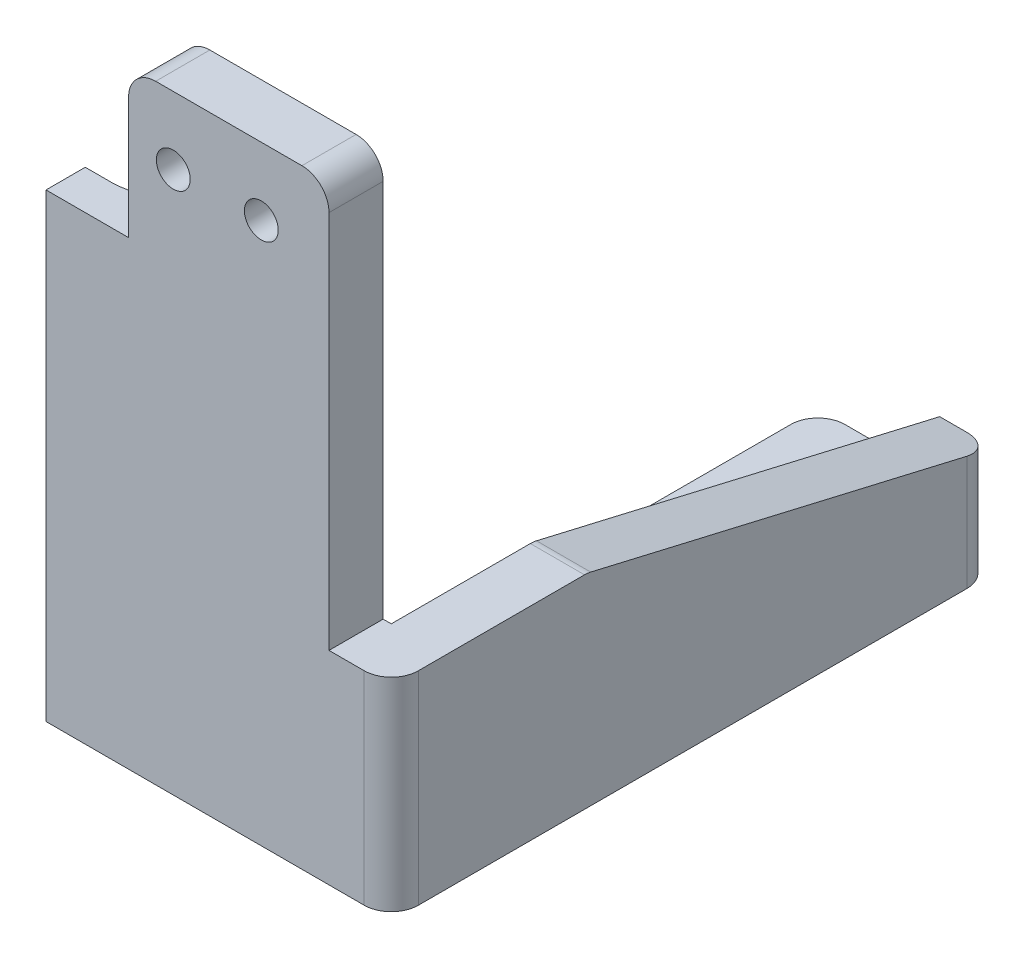
ISO-10303-21;
HEADER;
FILE_DESCRIPTION(('STEP AP214'),'2;1');
FILE_NAME('part.step','',(''),(''),'','','');
FILE_SCHEMA(('AUTOMOTIVE_DESIGN { 1 0 10303 214 1 1 1 1 }'));
ENDSEC;
DATA;
#1=APPLICATION_CONTEXT('core data for automotive mechanical design processes');
#2=APPLICATION_PROTOCOL_DEFINITION('international standard','automotive_design',2000,#1);
#3=PRODUCT_CONTEXT('',#1,'mechanical');
#4=PRODUCT('Part','Part','',(#3));
#5=PRODUCT_RELATED_PRODUCT_CATEGORY('part','',(#4));
#6=PRODUCT_DEFINITION_FORMATION('','',#4);
#7=PRODUCT_DEFINITION_CONTEXT('part definition',#1,'design');
#8=PRODUCT_DEFINITION('design','',#6,#7);
#9=PRODUCT_DEFINITION_SHAPE('','',#8);
#10=(LENGTH_UNIT() NAMED_UNIT(*) SI_UNIT(.MILLI.,.METRE.));
#11=(NAMED_UNIT(*) PLANE_ANGLE_UNIT() SI_UNIT($,.RADIAN.));
#12=(NAMED_UNIT(*) SI_UNIT($,.STERADIAN.) SOLID_ANGLE_UNIT());
#13=UNCERTAINTY_MEASURE_WITH_UNIT(LENGTH_MEASURE(1.E-05),#10,'distance_accuracy_value','');
#14=(GEOMETRIC_REPRESENTATION_CONTEXT(3) GLOBAL_UNCERTAINTY_ASSIGNED_CONTEXT((#13)) GLOBAL_UNIT_ASSIGNED_CONTEXT((#10,
#11,#12)) REPRESENTATION_CONTEXT('',''));
#15=CARTESIAN_POINT('',(0.,0.,0.));
#16=DIRECTION('',(0.,0.,1.));
#17=DIRECTION('',(1.,0.,0.));
#18=AXIS2_PLACEMENT_3D('',#15,#16,#17);
#19=CARTESIAN_POINT('',(0.,-36.,0.));
#20=DIRECTION('',(0.,1.,0.));
#21=DIRECTION('',(0.,0.,1.));
#22=AXIS2_PLACEMENT_3D('',#19,#20,#21);
#23=PLANE('',#22);
#24=CARTESIAN_POINT('',(4.35000000000001,-36.,-37.5));
#25=DIRECTION('',(0.,-1.,0.));
#26=DIRECTION('',(0.,0.,-1.));
#27=AXIS2_PLACEMENT_3D('',#24,#25,#26);
#28=CIRCLE('',#27,1.75);
#29=CARTESIAN_POINT('',(4.35000000000001,-36.,-39.25));
#30=VERTEX_POINT('',#29);
#31=EDGE_CURVE('E250',#30,#30,#28,.T.);
#32=ORIENTED_EDGE('',*,*,#31,.T.);
#33=EDGE_LOOP('',(#32));
#34=FACE_BOUND('',#33,.T.);
#35=CARTESIAN_POINT('',(4.35000000000001,-36.,-6.5));
#36=DIRECTION('',(0.,-1.,0.));
#37=DIRECTION('',(0.,0.,-1.));
#38=AXIS2_PLACEMENT_3D('',#35,#36,#37);
#39=CIRCLE('',#38,1.75);
#40=CARTESIAN_POINT('',(4.35000000000001,-36.,-8.25));
#41=VERTEX_POINT('',#40);
#42=EDGE_CURVE('E241',#41,#41,#39,.T.);
#43=ORIENTED_EDGE('',*,*,#42,.T.);
#44=EDGE_LOOP('',(#43));
#45=FACE_BOUND('',#44,.T.);
#46=DIRECTION('',(1.,0.,0.));
#47=VECTOR('',#46,1.);
#48=CARTESIAN_POINT('',(-0.149999999999992,-36.,-42.5));
#49=LINE('',#48,#47);
#50=CARTESIAN_POINT('',(1.85000000000001,-36.,-42.5));
#51=VERTEX_POINT('',#50);
#52=CARTESIAN_POINT('',(8.85000000000001,-36.,-42.5));
#53=VERTEX_POINT('',#52);
#54=EDGE_CURVE('E261',#51,#53,#49,.T.);
#55=ORIENTED_EDGE('',*,*,#54,.F.);
#56=CARTESIAN_POINT('',(1.85000000000001,-36.,-40.5));
#57=DIRECTION('',(0.,1.,0.));
#58=DIRECTION('',(0.,0.,1.));
#59=AXIS2_PLACEMENT_3D('',#56,#57,#58);
#60=CIRCLE('',#59,2.);
#61=CARTESIAN_POINT('',(-0.149999999999992,-36.,-40.5));
#62=VERTEX_POINT('',#61);
#63=EDGE_CURVE('E415',#51,#62,#60,.T.);
#64=ORIENTED_EDGE('',*,*,#63,.T.);
#65=DIRECTION('',(0.,0.,-1.));
#66=VECTOR('',#65,1.);
#67=CARTESIAN_POINT('',(-0.149999999999992,-36.,-42.5));
#68=LINE('',#67,#66);
#69=CARTESIAN_POINT('',(-0.149999999999992,-36.,-6.49999999999998));
#70=VERTEX_POINT('',#69);
#71=EDGE_CURVE('E257',#70,#62,#68,.T.);
#72=ORIENTED_EDGE('',*,*,#71,.F.);
#73=DIRECTION('',(-0.707106781186546,0.,-0.707106781186549));
#74=VECTOR('',#73,1.);
#75=CARTESIAN_POINT('',(-4.55,-36.,-10.9));
#76=LINE('',#75,#74);
#77=CARTESIAN_POINT('',(0.450000000000003,-36.,-5.89999999999998));
#78=VERTEX_POINT('',#77);
#79=EDGE_CURVE('E371',#70,#78,#76,.F.);
#80=ORIENTED_EDGE('',*,*,#79,.T.);
#81=DIRECTION('',(0.,0.,1.));
#82=VECTOR('',#81,1.);
#83=CARTESIAN_POINT('',(0.450000000000003,-36.,-2.));
#84=LINE('',#83,#82);
#85=CARTESIAN_POINT('',(0.450000000000003,-36.,-2.));
#86=VERTEX_POINT('',#85);
#87=EDGE_CURVE('E263',#78,#86,#84,.T.);
#88=ORIENTED_EDGE('',*,*,#87,.T.);
#89=DIRECTION('',(-1.,0.,0.));
#90=VECTOR('',#89,1.);
#91=CARTESIAN_POINT('',(0.,-36.,-2.));
#92=LINE('',#91,#90);
#93=CARTESIAN_POINT('',(8.85000000000001,-36.,-2.));
#94=VERTEX_POINT('',#93);
#95=EDGE_CURVE('E269',#94,#86,#92,.T.);
#96=ORIENTED_EDGE('',*,*,#95,.F.);
#97=DIRECTION('',(0.,0.,1.));
#98=VECTOR('',#97,1.);
#99=CARTESIAN_POINT('',(8.85000000000001,-36.,-42.5));
#100=LINE('',#99,#98);
#101=EDGE_CURVE('E236',#53,#94,#100,.T.);
#102=ORIENTED_EDGE('',*,*,#101,.F.);
#103=EDGE_LOOP('',(#55,#64,#72,#80,#88,#96,#102));
#104=FACE_BOUND('',#103,.T.);
#105=ADVANCED_FACE('F33',(#34,#45,#104),#23,.T.);
#106=CARTESIAN_POINT('',(0.,0.,2.));
#107=DIRECTION('',(0.,0.,1.));
#108=DIRECTION('',(1.,0.,0.));
#109=AXIS2_PLACEMENT_3D('',#106,#107,#108);
#110=PLANE('',#109);
#111=DIRECTION('',(0.,1.,0.));
#112=VECTOR('',#111,1.);
#113=CARTESIAN_POINT('',(8.25,5.,2.));
#114=LINE('',#113,#112);
#115=CARTESIAN_POINT('',(8.25000000000001,-25.,2.));
#116=VERTEX_POINT('',#115);
#117=CARTESIAN_POINT('',(8.25,3.,2.));
#118=VERTEX_POINT('',#117);
#119=EDGE_CURVE('E353',#116,#118,#114,.T.);
#120=ORIENTED_EDGE('',*,*,#119,.T.);
#121=CARTESIAN_POINT('',(6.25,3.,2.));
#122=DIRECTION('',(0.,0.,1.));
#123=DIRECTION('',(1.,0.,0.));
#124=AXIS2_PLACEMENT_3D('',#121,#122,#123);
#125=CIRCLE('',#124,2.);
#126=CARTESIAN_POINT('',(6.25,5.,2.));
#127=VERTEX_POINT('',#126);
#128=EDGE_CURVE('E41',#118,#127,#125,.T.);
#129=ORIENTED_EDGE('',*,*,#128,.T.);
#130=DIRECTION('',(-1.,0.,0.));
#131=VECTOR('',#130,1.);
#132=CARTESIAN_POINT('',(-6.55,5.,2.));
#133=LINE('',#132,#131);
#134=CARTESIAN_POINT('',(-4.55,5.,2.));
#135=VERTEX_POINT('',#134);
#136=EDGE_CURVE('E355',#127,#135,#133,.T.);
#137=ORIENTED_EDGE('',*,*,#136,.T.);
#138=CARTESIAN_POINT('',(-4.55,3.,2.));
#139=DIRECTION('',(0.,0.,1.));
#140=DIRECTION('',(1.,0.,0.));
#141=AXIS2_PLACEMENT_3D('',#138,#139,#140);
#142=CIRCLE('',#141,2.);
#143=CARTESIAN_POINT('',(-6.55,3.,2.));
#144=VERTEX_POINT('',#143);
#145=EDGE_CURVE('E48',#135,#144,#142,.T.);
#146=ORIENTED_EDGE('',*,*,#145,.T.);
#147=DIRECTION('',(0.,-1.,0.));
#148=VECTOR('',#147,1.);
#149=CARTESIAN_POINT('',(-6.55,5.,2.));
#150=LINE('',#149,#148);
#151=CARTESIAN_POINT('',(-6.55,-6.,2.));
#152=VERTEX_POINT('',#151);
#153=EDGE_CURVE('E347',#144,#152,#150,.T.);
#154=ORIENTED_EDGE('',*,*,#153,.T.);
#155=DIRECTION('',(-1.,0.,0.));
#156=VECTOR('',#155,1.);
#157=CARTESIAN_POINT('',(-12.65,-6.,2.));
#158=LINE('',#157,#156);
#159=CARTESIAN_POINT('',(-12.65,-6.,2.));
#160=VERTEX_POINT('',#159);
#161=EDGE_CURVE('E279',#152,#160,#158,.T.);
#162=ORIENTED_EDGE('',*,*,#161,.T.);
#163=DIRECTION('',(0.,-1.,0.));
#164=VECTOR('',#163,1.);
#165=CARTESIAN_POINT('',(-12.65,-6.,2.));
#166=LINE('',#165,#164);
#167=CARTESIAN_POINT('',(-12.65,-40.,2.));
#168=VERTEX_POINT('',#167);
#169=EDGE_CURVE('E302',#160,#168,#166,.T.);
#170=ORIENTED_EDGE('',*,*,#169,.T.);
#171=DIRECTION('',(1.,0.,0.));
#172=VECTOR('',#171,1.);
#173=CARTESIAN_POINT('',(-6.55,-40.,2.));
#174=LINE('',#173,#172);
#175=CARTESIAN_POINT('',(10.85,-40.,2.));
#176=VERTEX_POINT('',#175);
#177=EDGE_CURVE('E349',#168,#176,#174,.T.);
#178=ORIENTED_EDGE('',*,*,#177,.T.);
#179=DIRECTION('',(0.,-1.,0.));
#180=VECTOR('',#179,1.);
#181=CARTESIAN_POINT('',(10.85,-25.,2.));
#182=LINE('',#181,#180);
#183=CARTESIAN_POINT('',(10.85,-25.,2.));
#184=VERTEX_POINT('',#183);
#185=EDGE_CURVE('E405',#176,#184,#182,.F.);
#186=ORIENTED_EDGE('',*,*,#185,.T.);
#187=DIRECTION('',(1.,0.,0.));
#188=VECTOR('',#187,1.);
#189=CARTESIAN_POINT('',(8.25000000000001,-25.,2.));
#190=LINE('',#189,#188);
#191=EDGE_CURVE('E440',#116,#184,#190,.T.);
#192=ORIENTED_EDGE('',*,*,#191,.F.);
#193=EDGE_LOOP('',(#120,#129,#137,#146,#154,#162,#170,#178,#186,#192));
#194=FACE_BOUND('',#193,.T.);
#195=CARTESIAN_POINT('',(-3.25,0.,2.));
#196=DIRECTION('',(0.,0.,1.));
#197=DIRECTION('',(1.,0.,0.));
#198=AXIS2_PLACEMENT_3D('',#195,#196,#197);
#199=CIRCLE('',#198,1.25);
#200=CARTESIAN_POINT('',(-2.,0.,2.));
#201=VERTEX_POINT('',#200);
#202=EDGE_CURVE('E341',#201,#201,#199,.T.);
#203=ORIENTED_EDGE('',*,*,#202,.F.);
#204=EDGE_LOOP('',(#203));
#205=FACE_BOUND('',#204,.T.);
#206=CARTESIAN_POINT('',(3.25,0.,2.));
#207=DIRECTION('',(0.,0.,1.));
#208=DIRECTION('',(-1.,0.,0.));
#209=AXIS2_PLACEMENT_3D('',#206,#207,#208);
#210=CIRCLE('',#209,1.25);
#211=CARTESIAN_POINT('',(2.,0.,2.));
#212=VERTEX_POINT('',#211);
#213=EDGE_CURVE('E335',#212,#212,#210,.T.);
#214=ORIENTED_EDGE('',*,*,#213,.F.);
#215=EDGE_LOOP('',(#214));
#216=FACE_BOUND('',#215,.T.);
#217=ADVANCED_FACE('F429',(#194,#205,#216),#110,.T.);
#218=CARTESIAN_POINT('',(0.,0.,-2.));
#219=DIRECTION('',(0.,0.,1.));
#220=DIRECTION('',(1.,0.,0.));
#221=AXIS2_PLACEMENT_3D('',#218,#219,#220);
#222=PLANE('',#221);
#223=DIRECTION('',(-1.,0.,0.));
#224=VECTOR('',#223,1.);
#225=CARTESIAN_POINT('',(-6.55,5.,-2.));
#226=LINE('',#225,#224);
#227=CARTESIAN_POINT('',(6.25,5.,-2.));
#228=VERTEX_POINT('',#227);
#229=CARTESIAN_POINT('',(-4.55,5.,-2.));
#230=VERTEX_POINT('',#229);
#231=EDGE_CURVE('E350',#228,#230,#226,.T.);
#232=ORIENTED_EDGE('',*,*,#231,.F.);
#233=CARTESIAN_POINT('',(6.25,3.,-2.));
#234=DIRECTION('',(0.,0.,1.));
#235=DIRECTION('',(1.,0.,0.));
#236=AXIS2_PLACEMENT_3D('',#233,#234,#235);
#237=CIRCLE('',#236,2.);
#238=CARTESIAN_POINT('',(8.25,3.,-2.));
#239=VERTEX_POINT('',#238);
#240=EDGE_CURVE('E424',#228,#239,#237,.F.);
#241=ORIENTED_EDGE('',*,*,#240,.T.);
#242=DIRECTION('',(0.,1.,0.));
#243=VECTOR('',#242,1.);
#244=CARTESIAN_POINT('',(8.25,5.,-2.));
#245=LINE('',#244,#243);
#246=CARTESIAN_POINT('',(8.25000000000001,-25.,-2.));
#247=VERTEX_POINT('',#246);
#248=EDGE_CURVE('E229',#247,#239,#245,.T.);
#249=ORIENTED_EDGE('',*,*,#248,.F.);
#250=DIRECTION('',(-1.,0.,0.));
#251=VECTOR('',#250,1.);
#252=CARTESIAN_POINT('',(8.25000000000001,-25.,-2.));
#253=LINE('',#252,#251);
#254=CARTESIAN_POINT('',(8.85000000000001,-25.,-2.));
#255=VERTEX_POINT('',#254);
#256=EDGE_CURVE('E213',#255,#247,#253,.T.);
#257=ORIENTED_EDGE('',*,*,#256,.F.);
#258=DIRECTION('',(0.,-1.,0.));
#259=VECTOR('',#258,1.);
#260=CARTESIAN_POINT('',(8.85000000000001,-25.,-2.));
#261=LINE('',#260,#259);
#262=EDGE_CURVE('E228',#255,#94,#261,.T.);
#263=ORIENTED_EDGE('',*,*,#262,.T.);
#264=ORIENTED_EDGE('',*,*,#95,.T.);
#265=DIRECTION('',(0.,-1.,0.));
#266=VECTOR('',#265,1.);
#267=CARTESIAN_POINT('',(0.450000000000003,-6.,-2.));
#268=LINE('',#267,#266);
#269=CARTESIAN_POINT('',(0.450000000000003,-6.,-2.));
#270=VERTEX_POINT('',#269);
#271=EDGE_CURVE('E319',#270,#86,#268,.T.);
#272=ORIENTED_EDGE('',*,*,#271,.F.);
#273=DIRECTION('',(-1.,0.,0.));
#274=VECTOR('',#273,1.);
#275=CARTESIAN_POINT('',(-6.55,-6.,-2.));
#276=LINE('',#275,#274);
#277=CARTESIAN_POINT('',(-6.55,-6.,-2.));
#278=VERTEX_POINT('',#277);
#279=EDGE_CURVE('E272',#270,#278,#276,.T.);
#280=ORIENTED_EDGE('',*,*,#279,.T.);
#281=DIRECTION('',(0.,-1.,0.));
#282=VECTOR('',#281,1.);
#283=CARTESIAN_POINT('',(-6.55,5.,-2.));
#284=LINE('',#283,#282);
#285=CARTESIAN_POINT('',(-6.55,3.,-2.));
#286=VERTEX_POINT('',#285);
#287=EDGE_CURVE('E344',#286,#278,#284,.T.);
#288=ORIENTED_EDGE('',*,*,#287,.F.);
#289=CARTESIAN_POINT('',(-4.55,3.,-2.));
#290=DIRECTION('',(0.,0.,1.));
#291=DIRECTION('',(1.,0.,0.));
#292=AXIS2_PLACEMENT_3D('',#289,#290,#291);
#293=CIRCLE('',#292,2.);
#294=EDGE_CURVE('E422',#286,#230,#293,.F.);
#295=ORIENTED_EDGE('',*,*,#294,.T.);
#296=EDGE_LOOP('',(#232,#241,#249,#257,#263,#264,#272,#280,#288,#295));
#297=FACE_BOUND('',#296,.T.);
#298=CARTESIAN_POINT('',(-3.25,0.,-2.));
#299=DIRECTION('',(0.,0.,1.));
#300=DIRECTION('',(1.,0.,0.));
#301=AXIS2_PLACEMENT_3D('',#298,#299,#300);
#302=CIRCLE('',#301,1.25);
#303=CARTESIAN_POINT('',(-2.,0.,-2.));
#304=VERTEX_POINT('',#303);
#305=EDGE_CURVE('E338',#304,#304,#302,.T.);
#306=ORIENTED_EDGE('',*,*,#305,.T.);
#307=EDGE_LOOP('',(#306));
#308=FACE_BOUND('',#307,.T.);
#309=CARTESIAN_POINT('',(3.25,0.,-2.));
#310=DIRECTION('',(0.,0.,1.));
#311=DIRECTION('',(-1.,0.,0.));
#312=AXIS2_PLACEMENT_3D('',#309,#310,#311);
#313=CIRCLE('',#312,1.25);
#314=CARTESIAN_POINT('',(2.,0.,-2.));
#315=VERTEX_POINT('',#314);
#316=EDGE_CURVE('E322',#315,#315,#313,.T.);
#317=ORIENTED_EDGE('',*,*,#316,.T.);
#318=EDGE_LOOP('',(#317));
#319=FACE_BOUND('',#318,.T.);
#320=ADVANCED_FACE('F225',(#297,#308,#319),#222,.F.);
#321=CARTESIAN_POINT('',(-6.55,5.,2.));
#322=DIRECTION('',(1.,0.,0.));
#323=DIRECTION('',(0.,1.,0.));
#324=AXIS2_PLACEMENT_3D('',#321,#322,#323);
#325=PLANE('',#324);
#326=ORIENTED_EDGE('',*,*,#153,.F.);
#327=DIRECTION('',(0.,0.,-1.));
#328=VECTOR('',#327,1.);
#329=CARTESIAN_POINT('',(-6.55,3.,2.));
#330=LINE('',#329,#328);
#331=EDGE_CURVE('E11',#144,#286,#330,.T.);
#332=ORIENTED_EDGE('',*,*,#331,.T.);
#333=ORIENTED_EDGE('',*,*,#287,.T.);
#334=DIRECTION('',(0.,0.,1.));
#335=VECTOR('',#334,1.);
#336=CARTESIAN_POINT('',(-6.55,-6.,-2.));
#337=LINE('',#336,#335);
#338=EDGE_CURVE('E275',#278,#152,#337,.T.);
#339=ORIENTED_EDGE('',*,*,#338,.T.);
#340=EDGE_LOOP('',(#326,#332,#333,#339));
#341=FACE_BOUND('',#340,.T.);
#342=ADVANCED_FACE('F482',(#341),#325,.F.);
#343=CARTESIAN_POINT('',(-6.55,-40.,2.));
#344=DIRECTION('',(0.,1.,0.));
#345=DIRECTION('',(0.,0.,1.));
#346=AXIS2_PLACEMENT_3D('',#343,#344,#345);
#347=PLANE('',#346);
#348=DIRECTION('',(0.,0.,-1.));
#349=VECTOR('',#348,1.);
#350=CARTESIAN_POINT('',(12.85,-40.,-42.5));
#351=LINE('',#350,#349);
#352=CARTESIAN_POINT('',(12.85,-40.,0.));
#353=VERTEX_POINT('',#352);
#354=CARTESIAN_POINT('',(12.85,-40.,-40.5));
#355=VERTEX_POINT('',#354);
#356=EDGE_CURVE('E219',#353,#355,#351,.T.);
#357=ORIENTED_EDGE('',*,*,#356,.F.);
#358=CARTESIAN_POINT('',(10.85,-40.,0.));
#359=DIRECTION('',(0.,1.,0.));
#360=DIRECTION('',(0.,0.,1.));
#361=AXIS2_PLACEMENT_3D('',#358,#359,#360);
#362=CIRCLE('',#361,2.);
#363=EDGE_CURVE('E403',#353,#176,#362,.F.);
#364=ORIENTED_EDGE('',*,*,#363,.T.);
#365=ORIENTED_EDGE('',*,*,#177,.F.);
#366=DIRECTION('',(0.,0.,-1.));
#367=VECTOR('',#366,1.);
#368=CARTESIAN_POINT('',(-12.65,-40.,-0.9));
#369=LINE('',#368,#367);
#370=CARTESIAN_POINT('',(-12.65,-40.,-0.9));
#371=VERTEX_POINT('',#370);
#372=EDGE_CURVE('E271',#168,#371,#369,.T.);
#373=ORIENTED_EDGE('',*,*,#372,.T.);
#374=DIRECTION('',(1.,0.,0.));
#375=VECTOR('',#374,1.);
#376=CARTESIAN_POINT('',(-10.65,-40.,-0.900000000000001));
#377=LINE('',#376,#375);
#378=CARTESIAN_POINT('',(-10.65,-40.,-0.900000000000001));
#379=VERTEX_POINT('',#378);
#380=EDGE_CURVE('E305',#371,#379,#377,.T.);
#381=ORIENTED_EDGE('',*,*,#380,.T.);
#382=CARTESIAN_POINT('',(-10.65,-40.,-5.));
#383=DIRECTION('',(0.,1.,0.));
#384=DIRECTION('',(0.,0.,1.));
#385=AXIS2_PLACEMENT_3D('',#382,#383,#384);
#386=CIRCLE('',#385,4.1);
#387=CARTESIAN_POINT('',(-10.65,-40.,-9.1));
#388=VERTEX_POINT('',#387);
#389=EDGE_CURVE('E308',#379,#388,#386,.T.);
#390=ORIENTED_EDGE('',*,*,#389,.T.);
#391=DIRECTION('',(-1.,0.,0.));
#392=VECTOR('',#391,1.);
#393=CARTESIAN_POINT('',(-12.65,-40.,-9.1));
#394=LINE('',#393,#392);
#395=CARTESIAN_POINT('',(-12.65,-40.,-9.1));
#396=VERTEX_POINT('',#395);
#397=EDGE_CURVE('E311',#388,#396,#394,.T.);
#398=ORIENTED_EDGE('',*,*,#397,.T.);
#399=DIRECTION('',(0.,0.,-1.));
#400=VECTOR('',#399,1.);
#401=CARTESIAN_POINT('',(-12.65,-40.,-10.9));
#402=LINE('',#401,#400);
#403=CARTESIAN_POINT('',(-12.65,-40.,-10.9));
#404=VERTEX_POINT('',#403);
#405=EDGE_CURVE('E314',#396,#404,#402,.T.);
#406=ORIENTED_EDGE('',*,*,#405,.T.);
#407=DIRECTION('',(1.,0.,0.));
#408=VECTOR('',#407,1.);
#409=CARTESIAN_POINT('',(0.450000000000003,-40.,-10.9));
#410=LINE('',#409,#408);
#411=CARTESIAN_POINT('',(-4.55,-40.,-10.9));
#412=VERTEX_POINT('',#411);
#413=EDGE_CURVE('E276',#404,#412,#410,.T.);
#414=ORIENTED_EDGE('',*,*,#413,.T.);
#415=DIRECTION('',(-0.707106781186546,0.,-0.707106781186549));
#416=VECTOR('',#415,1.);
#417=CARTESIAN_POINT('',(-4.55,-40.,-10.9));
#418=LINE('',#417,#416);
#419=CARTESIAN_POINT('',(-0.149999999999992,-40.,-6.49999999999998));
#420=VERTEX_POINT('',#419);
#421=EDGE_CURVE('E364',#412,#420,#418,.F.);
#422=ORIENTED_EDGE('',*,*,#421,.T.);
#423=DIRECTION('',(0.,0.,-1.));
#424=VECTOR('',#423,1.);
#425=CARTESIAN_POINT('',(-0.149999999999992,-40.,-42.5));
#426=LINE('',#425,#424);
#427=CARTESIAN_POINT('',(-0.149999999999992,-40.,-40.5));
#428=VERTEX_POINT('',#427);
#429=EDGE_CURVE('E253',#420,#428,#426,.T.);
#430=ORIENTED_EDGE('',*,*,#429,.T.);
#431=CARTESIAN_POINT('',(1.85000000000001,-40.,-40.5));
#432=DIRECTION('',(0.,1.,0.));
#433=DIRECTION('',(0.,0.,1.));
#434=AXIS2_PLACEMENT_3D('',#431,#432,#433);
#435=CIRCLE('',#434,2.);
#436=CARTESIAN_POINT('',(1.85000000000001,-40.,-42.5));
#437=VERTEX_POINT('',#436);
#438=EDGE_CURVE('E399',#428,#437,#435,.F.);
#439=ORIENTED_EDGE('',*,*,#438,.T.);
#440=DIRECTION('',(1.,0.,0.));
#441=VECTOR('',#440,1.);
#442=CARTESIAN_POINT('',(-0.149999999999992,-40.,-42.5));
#443=LINE('',#442,#441);
#444=CARTESIAN_POINT('',(10.85,-40.,-42.5));
#445=VERTEX_POINT('',#444);
#446=EDGE_CURVE('E258',#437,#445,#443,.T.);
#447=ORIENTED_EDGE('',*,*,#446,.T.);
#448=CARTESIAN_POINT('',(10.85,-40.,-40.5));
#449=DIRECTION('',(0.,1.,0.));
#450=DIRECTION('',(0.,0.,1.));
#451=AXIS2_PLACEMENT_3D('',#448,#449,#450);
#452=CIRCLE('',#451,2.);
#453=EDGE_CURVE('E401',#445,#355,#452,.F.);
#454=ORIENTED_EDGE('',*,*,#453,.T.);
#455=EDGE_LOOP('',(#357,#364,#365,#373,#381,#390,#398,#406,#414,#422,#430,#439,#447,#454));
#456=FACE_BOUND('',#455,.T.);
#457=CARTESIAN_POINT('',(4.35000000000001,-40.,-37.5));
#458=DIRECTION('',(0.,-1.,0.));
#459=DIRECTION('',(0.,0.,-1.));
#460=AXIS2_PLACEMENT_3D('',#457,#458,#459);
#461=CIRCLE('',#460,1.75);
#462=CARTESIAN_POINT('',(4.35000000000001,-40.,-39.25));
#463=VERTEX_POINT('',#462);
#464=EDGE_CURVE('E248',#463,#463,#461,.T.);
#465=ORIENTED_EDGE('',*,*,#464,.F.);
#466=EDGE_LOOP('',(#465));
#467=FACE_BOUND('',#466,.T.);
#468=CARTESIAN_POINT('',(4.35000000000001,-40.,-6.5));
#469=DIRECTION('',(0.,-1.,0.));
#470=DIRECTION('',(0.,0.,-1.));
#471=AXIS2_PLACEMENT_3D('',#468,#469,#470);
#472=CIRCLE('',#471,1.75);
#473=CARTESIAN_POINT('',(4.35000000000001,-40.,-8.25));
#474=VERTEX_POINT('',#473);
#475=EDGE_CURVE('E237',#474,#474,#472,.T.);
#476=ORIENTED_EDGE('',*,*,#475,.F.);
#477=EDGE_LOOP('',(#476));
#478=FACE_BOUND('',#477,.T.);
#479=ADVANCED_FACE('F551',(#456,#467,#478),#347,.F.);
#480=CARTESIAN_POINT('',(8.25,5.,2.));
#481=DIRECTION('',(-1.,0.,0.));
#482=DIRECTION('',(0.,-1.,0.));
#483=AXIS2_PLACEMENT_3D('',#480,#481,#482);
#484=PLANE('',#483);
#485=ORIENTED_EDGE('',*,*,#248,.T.);
#486=DIRECTION('',(0.,0.,-1.));
#487=VECTOR('',#486,1.);
#488=CARTESIAN_POINT('',(8.25,3.,2.));
#489=LINE('',#488,#487);
#490=EDGE_CURVE('E56',#239,#118,#489,.F.);
#491=ORIENTED_EDGE('',*,*,#490,.T.);
#492=ORIENTED_EDGE('',*,*,#119,.F.);
#493=DIRECTION('',(0.,0.,1.));
#494=VECTOR('',#493,1.);
#495=CARTESIAN_POINT('',(8.25000000000001,-25.,-2.));
#496=LINE('',#495,#494);
#497=EDGE_CURVE('E230',#247,#116,#496,.T.);
#498=ORIENTED_EDGE('',*,*,#497,.F.);
#499=EDGE_LOOP('',(#485,#491,#492,#498));
#500=FACE_BOUND('',#499,.T.);
#501=ADVANCED_FACE('F438',(#500),#484,.F.);
#502=CARTESIAN_POINT('',(-6.55,5.,2.));
#503=DIRECTION('',(0.,-1.,0.));
#504=DIRECTION('',(0.,0.,-1.));
#505=AXIS2_PLACEMENT_3D('',#502,#503,#504);
#506=PLANE('',#505);
#507=ORIENTED_EDGE('',*,*,#136,.F.);
#508=DIRECTION('',(0.,0.,-1.));
#509=VECTOR('',#508,1.);
#510=CARTESIAN_POINT('',(6.25,5.,2.));
#511=LINE('',#510,#509);
#512=EDGE_CURVE('E419',#127,#228,#511,.T.);
#513=ORIENTED_EDGE('',*,*,#512,.T.);
#514=ORIENTED_EDGE('',*,*,#231,.T.);
#515=DIRECTION('',(0.,0.,-1.));
#516=VECTOR('',#515,1.);
#517=CARTESIAN_POINT('',(-4.55,5.,2.));
#518=LINE('',#517,#516);
#519=EDGE_CURVE('E417',#230,#135,#518,.F.);
#520=ORIENTED_EDGE('',*,*,#519,.T.);
#521=EDGE_LOOP('',(#507,#513,#514,#520));
#522=FACE_BOUND('',#521,.T.);
#523=ADVANCED_FACE('F435',(#522),#506,.F.);
#524=CARTESIAN_POINT('',(-3.25,0.,2.));
#525=DIRECTION('',(0.,0.,-1.));
#526=DIRECTION('',(-1.,0.,0.));
#527=AXIS2_PLACEMENT_3D('',#524,#525,#526);
#528=CYLINDRICAL_SURFACE('',#527,1.25);
#529=ORIENTED_EDGE('',*,*,#202,.T.);
#530=EDGE_LOOP('',(#529));
#531=FACE_BOUND('',#530,.T.);
#532=ORIENTED_EDGE('',*,*,#305,.F.);
#533=EDGE_LOOP('',(#532));
#534=FACE_BOUND('',#533,.T.);
#535=ADVANCED_FACE('F540',(#531,#534),#528,.F.);
#536=CARTESIAN_POINT('',(3.25,0.,2.));
#537=DIRECTION('',(0.,0.,-1.));
#538=DIRECTION('',(-1.,0.,0.));
#539=AXIS2_PLACEMENT_3D('',#536,#537,#538);
#540=CYLINDRICAL_SURFACE('',#539,1.25);
#541=ORIENTED_EDGE('',*,*,#213,.T.);
#542=EDGE_LOOP('',(#541));
#543=FACE_BOUND('',#542,.T.);
#544=ORIENTED_EDGE('',*,*,#316,.F.);
#545=EDGE_LOOP('',(#544));
#546=FACE_BOUND('',#545,.T.);
#547=ADVANCED_FACE('F515',(#543,#546),#540,.F.);
#548=CARTESIAN_POINT('',(0.450000000000003,-6.,-2.));
#549=DIRECTION('',(1.,0.,0.));
#550=DIRECTION('',(0.,0.,-1.));
#551=AXIS2_PLACEMENT_3D('',#548,#549,#550);
#552=PLANE('',#551);
#553=ORIENTED_EDGE('',*,*,#87,.F.);
#554=DIRECTION('',(0.,1.,0.));
#555=VECTOR('',#554,1.);
#556=CARTESIAN_POINT('',(0.450000000000003,-6.,-5.89999999999998));
#557=LINE('',#556,#555);
#558=CARTESIAN_POINT('',(0.450000000000003,-6.,-5.89999999999998));
#559=VERTEX_POINT('',#558);
#560=EDGE_CURVE('E367',#78,#559,#557,.T.);
#561=ORIENTED_EDGE('',*,*,#560,.T.);
#562=DIRECTION('',(0.,0.,1.));
#563=VECTOR('',#562,1.);
#564=CARTESIAN_POINT('',(0.450000000000003,-6.,-2.));
#565=LINE('',#564,#563);
#566=EDGE_CURVE('E300',#559,#270,#565,.T.);
#567=ORIENTED_EDGE('',*,*,#566,.T.);
#568=ORIENTED_EDGE('',*,*,#271,.T.);
#569=EDGE_LOOP('',(#553,#561,#567,#568));
#570=FACE_BOUND('',#569,.T.);
#571=ADVANCED_FACE('F471',(#570),#552,.T.);
#572=CARTESIAN_POINT('',(0.450000000000003,-6.,-10.9));
#573=DIRECTION('',(0.,0.,-1.));
#574=DIRECTION('',(-1.,0.,0.));
#575=AXIS2_PLACEMENT_3D('',#572,#573,#574);
#576=PLANE('',#575);
#577=DIRECTION('',(1.,0.,0.));
#578=VECTOR('',#577,1.);
#579=CARTESIAN_POINT('',(0.450000000000003,-6.,-10.9));
#580=LINE('',#579,#578);
#581=CARTESIAN_POINT('',(-12.65,-6.,-10.9));
#582=VERTEX_POINT('',#581);
#583=CARTESIAN_POINT('',(-4.55,-6.,-10.9));
#584=VERTEX_POINT('',#583);
#585=EDGE_CURVE('E297',#582,#584,#580,.T.);
#586=ORIENTED_EDGE('',*,*,#585,.T.);
#587=DIRECTION('',(0.,-1.,0.));
#588=VECTOR('',#587,1.);
#589=CARTESIAN_POINT('',(-4.55,-6.,-10.9));
#590=LINE('',#589,#588);
#591=EDGE_CURVE('E357',#584,#412,#590,.T.);
#592=ORIENTED_EDGE('',*,*,#591,.T.);
#593=ORIENTED_EDGE('',*,*,#413,.F.);
#594=DIRECTION('',(0.,-1.,0.));
#595=VECTOR('',#594,1.);
#596=CARTESIAN_POINT('',(-12.65,-6.,-10.9));
#597=LINE('',#596,#595);
#598=EDGE_CURVE('E323',#582,#404,#597,.T.);
#599=ORIENTED_EDGE('',*,*,#598,.F.);
#600=EDGE_LOOP('',(#586,#592,#593,#599));
#601=FACE_BOUND('',#600,.T.);
#602=ADVANCED_FACE('F514',(#601),#576,.T.);
#603=CARTESIAN_POINT('',(-12.65,-6.,-10.9));
#604=DIRECTION('',(-1.,0.,0.));
#605=DIRECTION('',(0.,0.,1.));
#606=AXIS2_PLACEMENT_3D('',#603,#604,#605);
#607=PLANE('',#606);
#608=ORIENTED_EDGE('',*,*,#405,.F.);
#609=DIRECTION('',(0.,-1.,0.));
#610=VECTOR('',#609,1.);
#611=CARTESIAN_POINT('',(-12.65,-6.,-9.1));
#612=LINE('',#611,#610);
#613=CARTESIAN_POINT('',(-12.65,-6.,-9.1));
#614=VERTEX_POINT('',#613);
#615=EDGE_CURVE('E325',#614,#396,#612,.T.);
#616=ORIENTED_EDGE('',*,*,#615,.F.);
#617=DIRECTION('',(0.,0.,-1.));
#618=VECTOR('',#617,1.);
#619=CARTESIAN_POINT('',(-12.65,-6.,-10.9));
#620=LINE('',#619,#618);
#621=EDGE_CURVE('E294',#614,#582,#620,.T.);
#622=ORIENTED_EDGE('',*,*,#621,.T.);
#623=ORIENTED_EDGE('',*,*,#598,.T.);
#624=EDGE_LOOP('',(#608,#616,#622,#623));
#625=FACE_BOUND('',#624,.T.);
#626=ADVANCED_FACE('F518',(#625),#607,.T.);
#627=CARTESIAN_POINT('',(-12.65,-6.,-9.1));
#628=DIRECTION('',(0.,0.,1.));
#629=DIRECTION('',(1.,0.,0.));
#630=AXIS2_PLACEMENT_3D('',#627,#628,#629);
#631=PLANE('',#630);
#632=ORIENTED_EDGE('',*,*,#397,.F.);
#633=DIRECTION('',(0.,-1.,0.));
#634=VECTOR('',#633,1.);
#635=CARTESIAN_POINT('',(-10.65,-6.,-9.1));
#636=LINE('',#635,#634);
#637=CARTESIAN_POINT('',(-10.65,-6.,-9.1));
#638=VERTEX_POINT('',#637);
#639=EDGE_CURVE('E327',#638,#388,#636,.T.);
#640=ORIENTED_EDGE('',*,*,#639,.F.);
#641=DIRECTION('',(-1.,0.,0.));
#642=VECTOR('',#641,1.);
#643=CARTESIAN_POINT('',(-12.65,-6.,-9.1));
#644=LINE('',#643,#642);
#645=EDGE_CURVE('E291',#638,#614,#644,.T.);
#646=ORIENTED_EDGE('',*,*,#645,.T.);
#647=ORIENTED_EDGE('',*,*,#615,.T.);
#648=EDGE_LOOP('',(#632,#640,#646,#647));
#649=FACE_BOUND('',#648,.T.);
#650=ADVANCED_FACE('F522',(#649),#631,.T.);
#651=CARTESIAN_POINT('',(-10.65,-6.,-5.));
#652=DIRECTION('',(0.,-1.,0.));
#653=DIRECTION('',(0.,0.,-1.));
#654=AXIS2_PLACEMENT_3D('',#651,#652,#653);
#655=CYLINDRICAL_SURFACE('',#654,4.1);
#656=ORIENTED_EDGE('',*,*,#389,.F.);
#657=DIRECTION('',(0.,-1.,0.));
#658=VECTOR('',#657,1.);
#659=CARTESIAN_POINT('',(-10.65,-6.,-0.900000000000001));
#660=LINE('',#659,#658);
#661=CARTESIAN_POINT('',(-10.65,-6.,-0.900000000000001));
#662=VERTEX_POINT('',#661);
#663=EDGE_CURVE('E329',#662,#379,#660,.T.);
#664=ORIENTED_EDGE('',*,*,#663,.F.);
#665=CARTESIAN_POINT('',(-10.65,-6.,-5.));
#666=DIRECTION('',(0.,1.,0.));
#667=DIRECTION('',(0.,0.,1.));
#668=AXIS2_PLACEMENT_3D('',#665,#666,#667);
#669=CIRCLE('',#668,4.1);
#670=EDGE_CURVE('E288',#662,#638,#669,.T.);
#671=ORIENTED_EDGE('',*,*,#670,.T.);
#672=ORIENTED_EDGE('',*,*,#639,.T.);
#673=EDGE_LOOP('',(#656,#664,#671,#672));
#674=FACE_BOUND('',#673,.T.);
#675=ADVANCED_FACE('F526',(#674),#655,.F.);
#676=CARTESIAN_POINT('',(-10.65,-6.,-0.900000000000001));
#677=DIRECTION('',(0.,0.,-1.));
#678=DIRECTION('',(-1.,0.,0.));
#679=AXIS2_PLACEMENT_3D('',#676,#677,#678);
#680=PLANE('',#679);
#681=ORIENTED_EDGE('',*,*,#380,.F.);
#682=DIRECTION('',(0.,-1.,0.));
#683=VECTOR('',#682,1.);
#684=CARTESIAN_POINT('',(-12.65,-6.,-0.9));
#685=LINE('',#684,#683);
#686=CARTESIAN_POINT('',(-12.65,-6.,-0.9));
#687=VERTEX_POINT('',#686);
#688=EDGE_CURVE('E331',#687,#371,#685,.T.);
#689=ORIENTED_EDGE('',*,*,#688,.F.);
#690=DIRECTION('',(1.,0.,0.));
#691=VECTOR('',#690,1.);
#692=CARTESIAN_POINT('',(-10.65,-6.,-0.900000000000001));
#693=LINE('',#692,#691);
#694=EDGE_CURVE('E285',#687,#662,#693,.T.);
#695=ORIENTED_EDGE('',*,*,#694,.T.);
#696=ORIENTED_EDGE('',*,*,#663,.T.);
#697=EDGE_LOOP('',(#681,#689,#695,#696));
#698=FACE_BOUND('',#697,.T.);
#699=ADVANCED_FACE('F530',(#698),#680,.T.);
#700=CARTESIAN_POINT('',(-12.65,-6.,-0.9));
#701=DIRECTION('',(-1.,0.,0.));
#702=DIRECTION('',(0.,0.,1.));
#703=AXIS2_PLACEMENT_3D('',#700,#701,#702);
#704=PLANE('',#703);
#705=ORIENTED_EDGE('',*,*,#372,.F.);
#706=ORIENTED_EDGE('',*,*,#169,.F.);
#707=DIRECTION('',(0.,0.,-1.));
#708=VECTOR('',#707,1.);
#709=CARTESIAN_POINT('',(-12.65,-6.,-0.9));
#710=LINE('',#709,#708);
#711=EDGE_CURVE('E282',#160,#687,#710,.T.);
#712=ORIENTED_EDGE('',*,*,#711,.T.);
#713=ORIENTED_EDGE('',*,*,#688,.T.);
#714=EDGE_LOOP('',(#705,#706,#712,#713));
#715=FACE_BOUND('',#714,.T.);
#716=ADVANCED_FACE('F511',(#715),#704,.T.);
#717=CARTESIAN_POINT('',(-10.65,-6.,-5.));
#718=DIRECTION('',(0.,1.,0.));
#719=DIRECTION('',(0.,0.,1.));
#720=AXIS2_PLACEMENT_3D('',#717,#718,#719);
#721=PLANE('',#720);
#722=ORIENTED_EDGE('',*,*,#566,.F.);
#723=DIRECTION('',(0.707106781186546,0.,0.707106781186549));
#724=VECTOR('',#723,1.);
#725=CARTESIAN_POINT('',(-4.64999999999999,-6.,-11.));
#726=LINE('',#725,#724);
#727=EDGE_CURVE('E369',#559,#584,#726,.F.);
#728=ORIENTED_EDGE('',*,*,#727,.T.);
#729=ORIENTED_EDGE('',*,*,#585,.F.);
#730=ORIENTED_EDGE('',*,*,#621,.F.);
#731=ORIENTED_EDGE('',*,*,#645,.F.);
#732=ORIENTED_EDGE('',*,*,#670,.F.);
#733=ORIENTED_EDGE('',*,*,#694,.F.);
#734=ORIENTED_EDGE('',*,*,#711,.F.);
#735=ORIENTED_EDGE('',*,*,#161,.F.);
#736=ORIENTED_EDGE('',*,*,#338,.F.);
#737=ORIENTED_EDGE('',*,*,#279,.F.);
#738=EDGE_LOOP('',(#722,#728,#729,#730,#731,#732,#733,#734,#735,#736,#737));
#739=FACE_BOUND('',#738,.T.);
#740=ADVANCED_FACE('F478',(#739),#721,.T.);
#741=CARTESIAN_POINT('',(-4.55,-6.,-10.9));
#742=DIRECTION('',(-0.707106781186549,0.,0.707106781186546));
#743=DIRECTION('',(0.,-1.,0.));
#744=AXIS2_PLACEMENT_3D('',#741,#742,#743);
#745=PLANE('',#744);
#746=DIRECTION('',(0.,-1.,0.));
#747=VECTOR('',#746,1.);
#748=CARTESIAN_POINT('',(-0.149999999999992,-6.,-6.49999999999998));
#749=LINE('',#748,#747);
#750=EDGE_CURVE('E373',#420,#70,#749,.F.);
#751=ORIENTED_EDGE('',*,*,#750,.F.);
#752=ORIENTED_EDGE('',*,*,#421,.F.);
#753=ORIENTED_EDGE('',*,*,#591,.F.);
#754=ORIENTED_EDGE('',*,*,#727,.F.);
#755=ORIENTED_EDGE('',*,*,#560,.F.);
#756=ORIENTED_EDGE('',*,*,#79,.F.);
#757=EDGE_LOOP('',(#751,#752,#753,#754,#755,#756));
#758=FACE_BOUND('',#757,.T.);
#759=ADVANCED_FACE('F505',(#758),#745,.F.);
#760=CARTESIAN_POINT('',(-0.149999999999992,-36.,-42.5));
#761=DIRECTION('',(0.,0.,-1.));
#762=DIRECTION('',(-1.,0.,0.));
#763=AXIS2_PLACEMENT_3D('',#760,#761,#762);
#764=PLANE('',#763);
#765=DIRECTION('',(1.,0.,0.));
#766=VECTOR('',#765,1.);
#767=CARTESIAN_POINT('',(-0.149999999999992,-32.,-42.5));
#768=LINE('',#767,#766);
#769=CARTESIAN_POINT('',(8.85000000000001,-32.,-42.5));
#770=VERTEX_POINT('',#769);
#771=CARTESIAN_POINT('',(10.85,-32.,-42.5));
#772=VERTEX_POINT('',#771);
#773=EDGE_CURVE('E377',#770,#772,#768,.T.);
#774=ORIENTED_EDGE('',*,*,#773,.T.);
#775=DIRECTION('',(0.,-1.,0.));
#776=VECTOR('',#775,1.);
#777=CARTESIAN_POINT('',(10.85,-40.,-42.5));
#778=LINE('',#777,#776);
#779=EDGE_CURVE('E409',#772,#445,#778,.T.);
#780=ORIENTED_EDGE('',*,*,#779,.T.);
#781=ORIENTED_EDGE('',*,*,#446,.F.);
#782=DIRECTION('',(0.,-1.,0.));
#783=VECTOR('',#782,1.);
#784=CARTESIAN_POINT('',(1.85000000000001,-36.,-42.5));
#785=LINE('',#784,#783);
#786=EDGE_CURVE('E407',#437,#51,#785,.F.);
#787=ORIENTED_EDGE('',*,*,#786,.T.);
#788=ORIENTED_EDGE('',*,*,#54,.T.);
#789=DIRECTION('',(0.,-1.,0.));
#790=VECTOR('',#789,1.);
#791=CARTESIAN_POINT('',(8.85000000000001,-25.,-42.5));
#792=LINE('',#791,#790);
#793=EDGE_CURVE('E238',#770,#53,#792,.T.);
#794=ORIENTED_EDGE('',*,*,#793,.F.);
#795=EDGE_LOOP('',(#774,#780,#781,#787,#788,#794));
#796=FACE_BOUND('',#795,.T.);
#797=ADVANCED_FACE('F463',(#796),#764,.T.);
#798=CARTESIAN_POINT('',(-0.149999999999992,-36.,-42.5));
#799=DIRECTION('',(-1.,0.,0.));
#800=DIRECTION('',(0.,0.,1.));
#801=AXIS2_PLACEMENT_3D('',#798,#799,#800);
#802=PLANE('',#801);
#803=ORIENTED_EDGE('',*,*,#71,.T.);
#804=DIRECTION('',(0.,-1.,0.));
#805=VECTOR('',#804,1.);
#806=CARTESIAN_POINT('',(-0.149999999999992,-36.,-40.5));
#807=LINE('',#806,#805);
#808=EDGE_CURVE('E412',#62,#428,#807,.T.);
#809=ORIENTED_EDGE('',*,*,#808,.T.);
#810=ORIENTED_EDGE('',*,*,#429,.F.);
#811=ORIENTED_EDGE('',*,*,#750,.T.);
#812=EDGE_LOOP('',(#803,#809,#810,#811));
#813=FACE_BOUND('',#812,.T.);
#814=ADVANCED_FACE('F504',(#813),#802,.T.);
#815=CARTESIAN_POINT('',(4.35000000000001,-36.,-37.5));
#816=DIRECTION('',(0.,-1.,0.));
#817=DIRECTION('',(0.,0.,-1.));
#818=AXIS2_PLACEMENT_3D('',#815,#816,#817);
#819=CYLINDRICAL_SURFACE('',#818,1.75);
#820=ORIENTED_EDGE('',*,*,#31,.F.);
#821=EDGE_LOOP('',(#820));
#822=FACE_BOUND('',#821,.T.);
#823=ORIENTED_EDGE('',*,*,#464,.T.);
#824=EDGE_LOOP('',(#823));
#825=FACE_BOUND('',#824,.T.);
#826=ADVANCED_FACE('F500',(#822,#825),#819,.F.);
#827=CARTESIAN_POINT('',(4.35000000000001,-36.,-6.5));
#828=DIRECTION('',(0.,-1.,0.));
#829=DIRECTION('',(0.,0.,-1.));
#830=AXIS2_PLACEMENT_3D('',#827,#828,#829);
#831=CYLINDRICAL_SURFACE('',#830,1.75);
#832=ORIENTED_EDGE('',*,*,#42,.F.);
#833=EDGE_LOOP('',(#832));
#834=FACE_BOUND('',#833,.T.);
#835=ORIENTED_EDGE('',*,*,#475,.T.);
#836=EDGE_LOOP('',(#835));
#837=FACE_BOUND('',#836,.T.);
#838=ADVANCED_FACE('F602',(#834,#837),#831,.F.);
#839=CARTESIAN_POINT('',(8.85000000000001,-25.,-42.5));
#840=DIRECTION('',(1.,0.,0.));
#841=DIRECTION('',(0.,0.,-1.));
#842=AXIS2_PLACEMENT_3D('',#839,#840,#841);
#843=PLANE('',#842);
#844=DIRECTION('',(0.,0.,1.));
#845=VECTOR('',#844,1.);
#846=CARTESIAN_POINT('',(8.85000000000001,-25.,-42.5));
#847=LINE('',#846,#845);
#848=CARTESIAN_POINT('',(8.85000000000001,-25.,-12.2697589709999));
#849=VERTEX_POINT('',#848);
#850=EDGE_CURVE('E209',#849,#255,#847,.T.);
#851=ORIENTED_EDGE('',*,*,#850,.F.);
#852=CARTESIAN_POINT('',(8.85000000000001,-27.,-12.2697589709999));
#853=DIRECTION('',(1.,0.,0.));
#854=DIRECTION('',(0.,0.,-1.));
#855=AXIS2_PLACEMENT_3D('',#852,#853,#854);
#856=CIRCLE('',#855,2.);
#857=CARTESIAN_POINT('',(8.85000000000001,-25.0523175805164,-12.7242182022128));
#858=VERTEX_POINT('',#857);
#859=EDGE_CURVE('E386',#849,#858,#856,.F.);
#860=ORIENTED_EDGE('',*,*,#859,.T.);
#861=DIRECTION('',(0.,0.227229615606415,0.973841209741794));
#862=VECTOR('',#861,1.);
#863=CARTESIAN_POINT('',(8.85000000000001,-25.,-12.4999999999996));
#864=LINE('',#863,#862);
#865=EDGE_CURVE('E375',#858,#770,#864,.F.);
#866=ORIENTED_EDGE('',*,*,#865,.T.);
#867=ORIENTED_EDGE('',*,*,#793,.T.);
#868=ORIENTED_EDGE('',*,*,#101,.T.);
#869=ORIENTED_EDGE('',*,*,#262,.F.);
#870=EDGE_LOOP('',(#851,#860,#866,#867,#868,#869));
#871=FACE_BOUND('',#870,.T.);
#872=ADVANCED_FACE('F233',(#871),#843,.F.);
#873=CARTESIAN_POINT('',(12.85,-25.,-42.5));
#874=DIRECTION('',(-1.,0.,0.));
#875=DIRECTION('',(0.,0.,1.));
#876=AXIS2_PLACEMENT_3D('',#873,#874,#875);
#877=PLANE('',#876);
#878=DIRECTION('',(0.,-0.227229615606415,-0.973841209741794));
#879=VECTOR('',#878,1.);
#880=CARTESIAN_POINT('',(12.85,-25.,-12.4999999999996));
#881=LINE('',#880,#879);
#882=CARTESIAN_POINT('',(12.85,-31.5333333333333,-40.5));
#883=VERTEX_POINT('',#882);
#884=CARTESIAN_POINT('',(12.85,-25.0523175805164,-12.7242182022128));
#885=VERTEX_POINT('',#884);
#886=EDGE_CURVE('E380',#883,#885,#881,.F.);
#887=ORIENTED_EDGE('',*,*,#886,.T.);
#888=CARTESIAN_POINT('',(12.85,-27.,-12.2697589709999));
#889=DIRECTION('',(-1.,0.,0.));
#890=DIRECTION('',(0.,0.,1.));
#891=AXIS2_PLACEMENT_3D('',#888,#889,#890);
#892=CIRCLE('',#891,2.);
#893=CARTESIAN_POINT('',(12.85,-25.,-12.2697589709999));
#894=VERTEX_POINT('',#893);
#895=EDGE_CURVE('E397',#885,#894,#892,.F.);
#896=ORIENTED_EDGE('',*,*,#895,.T.);
#897=DIRECTION('',(0.,0.,-1.));
#898=VECTOR('',#897,1.);
#899=CARTESIAN_POINT('',(12.85,-25.,-42.5));
#900=LINE('',#899,#898);
#901=CARTESIAN_POINT('',(12.85,-25.,0.));
#902=VERTEX_POINT('',#901);
#903=EDGE_CURVE('E243',#902,#894,#900,.T.);
#904=ORIENTED_EDGE('',*,*,#903,.F.);
#905=DIRECTION('',(0.,-1.,0.));
#906=VECTOR('',#905,1.);
#907=CARTESIAN_POINT('',(12.85,-40.,0.));
#908=LINE('',#907,#906);
#909=EDGE_CURVE('E394',#902,#353,#908,.T.);
#910=ORIENTED_EDGE('',*,*,#909,.T.);
#911=ORIENTED_EDGE('',*,*,#356,.T.);
#912=DIRECTION('',(0.,-1.,0.));
#913=VECTOR('',#912,1.);
#914=CARTESIAN_POINT('',(12.85,-32.,-40.5));
#915=LINE('',#914,#913);
#916=EDGE_CURVE('E392',#355,#883,#915,.F.);
#917=ORIENTED_EDGE('',*,*,#916,.T.);
#918=EDGE_LOOP('',(#887,#896,#904,#910,#911,#917));
#919=FACE_BOUND('',#918,.T.);
#920=ADVANCED_FACE('F448',(#919),#877,.F.);
#921=CARTESIAN_POINT('',(0.,-25.,0.));
#922=DIRECTION('',(0.,1.,0.));
#923=DIRECTION('',(0.,0.,1.));
#924=AXIS2_PLACEMENT_3D('',#921,#922,#923);
#925=PLANE('',#924);
#926=ORIENTED_EDGE('',*,*,#903,.T.);
#927=DIRECTION('',(1.,0.,0.));
#928=VECTOR('',#927,1.);
#929=CARTESIAN_POINT('',(0.,-25.,-12.2697589709999));
#930=LINE('',#929,#928);
#931=EDGE_CURVE('E216',#894,#849,#930,.F.);
#932=ORIENTED_EDGE('',*,*,#931,.T.);
#933=ORIENTED_EDGE('',*,*,#850,.T.);
#934=ORIENTED_EDGE('',*,*,#256,.T.);
#935=ORIENTED_EDGE('',*,*,#497,.T.);
#936=ORIENTED_EDGE('',*,*,#191,.T.);
#937=CARTESIAN_POINT('',(10.85,-25.,0.));
#938=DIRECTION('',(0.,1.,0.));
#939=DIRECTION('',(0.,0.,1.));
#940=AXIS2_PLACEMENT_3D('',#937,#938,#939);
#941=CIRCLE('',#940,2.);
#942=EDGE_CURVE('E383',#184,#902,#941,.T.);
#943=ORIENTED_EDGE('',*,*,#942,.T.);
#944=EDGE_LOOP('',(#926,#932,#933,#934,#935,#936,#943));
#945=FACE_BOUND('',#944,.T.);
#946=ADVANCED_FACE('F212',(#945),#925,.T.);
#947=CARTESIAN_POINT('',(0.,-25.,-12.4999999999996));
#948=DIRECTION('',(0.,-0.973841209741794,0.227229615606415));
#949=DIRECTION('',(-1.,0.,0.));
#950=AXIS2_PLACEMENT_3D('',#947,#948,#949);
#951=PLANE('',#950);
#952=ORIENTED_EDGE('',*,*,#865,.F.);
#953=DIRECTION('',(-1.,0.,0.));
#954=VECTOR('',#953,1.);
#955=CARTESIAN_POINT('',(0.,-25.0523175805164,-12.7242182022128));
#956=LINE('',#955,#954);
#957=EDGE_CURVE('E390',#858,#885,#956,.F.);
#958=ORIENTED_EDGE('',*,*,#957,.T.);
#959=ORIENTED_EDGE('',*,*,#886,.F.);
#960=CARTESIAN_POINT('',(10.85,-31.5333333333333,-40.5));
#961=DIRECTION('',(0.,-0.973841209741794,0.227229615606415));
#962=DIRECTION('',(0.,0.227229615606415,0.973841209741794));
#963=AXIS2_PLACEMENT_3D('',#960,#961,#962);
#964=ELLIPSE('',#963,2.05372290676658,2.);
#965=EDGE_CURVE('E388',#883,#772,#964,.F.);
#966=ORIENTED_EDGE('',*,*,#965,.T.);
#967=ORIENTED_EDGE('',*,*,#773,.F.);
#968=EDGE_LOOP('',(#952,#958,#959,#966,#967));
#969=FACE_BOUND('',#968,.T.);
#970=ADVANCED_FACE('F460',(#969),#951,.F.);
#971=CARTESIAN_POINT('',(0.,-27.,-12.2697589709999));
#972=DIRECTION('',(1.,0.,0.));
#973=DIRECTION('',(0.,0.,-1.));
#974=AXIS2_PLACEMENT_3D('',#971,#972,#973);
#975=CYLINDRICAL_SURFACE('',#974,2.);
#976=ORIENTED_EDGE('',*,*,#895,.F.);
#977=ORIENTED_EDGE('',*,*,#957,.F.);
#978=ORIENTED_EDGE('',*,*,#859,.F.);
#979=ORIENTED_EDGE('',*,*,#931,.F.);
#980=EDGE_LOOP('',(#976,#977,#978,#979));
#981=FACE_BOUND('',#980,.T.);
#982=ADVANCED_FACE('F561',(#981),#975,.T.);
#983=CARTESIAN_POINT('',(10.85,-25.,0.));
#984=DIRECTION('',(0.,1.,0.));
#985=DIRECTION('',(0.,0.,1.));
#986=AXIS2_PLACEMENT_3D('',#983,#984,#985);
#987=CYLINDRICAL_SURFACE('',#986,2.);
#988=ORIENTED_EDGE('',*,*,#942,.F.);
#989=ORIENTED_EDGE('',*,*,#185,.F.);
#990=ORIENTED_EDGE('',*,*,#363,.F.);
#991=ORIENTED_EDGE('',*,*,#909,.F.);
#992=EDGE_LOOP('',(#988,#989,#990,#991));
#993=FACE_BOUND('',#992,.T.);
#994=ADVANCED_FACE('F564',(#993),#987,.T.);
#995=CARTESIAN_POINT('',(10.85,-36.,-40.5));
#996=DIRECTION('',(0.,1.,0.));
#997=DIRECTION('',(0.,0.,1.));
#998=AXIS2_PLACEMENT_3D('',#995,#996,#997);
#999=CYLINDRICAL_SURFACE('',#998,2.);
#1000=ORIENTED_EDGE('',*,*,#965,.F.);
#1001=ORIENTED_EDGE('',*,*,#916,.F.);
#1002=ORIENTED_EDGE('',*,*,#453,.F.);
#1003=ORIENTED_EDGE('',*,*,#779,.F.);
#1004=EDGE_LOOP('',(#1000,#1001,#1002,#1003));
#1005=FACE_BOUND('',#1004,.T.);
#1006=ADVANCED_FACE('F455',(#1005),#999,.T.);
#1007=CARTESIAN_POINT('',(1.85000000000001,-36.,-40.5));
#1008=DIRECTION('',(0.,-1.,0.));
#1009=DIRECTION('',(0.,0.,-1.));
#1010=AXIS2_PLACEMENT_3D('',#1007,#1008,#1009);
#1011=CYLINDRICAL_SURFACE('',#1010,2.);
#1012=ORIENTED_EDGE('',*,*,#63,.F.);
#1013=ORIENTED_EDGE('',*,*,#786,.F.);
#1014=ORIENTED_EDGE('',*,*,#438,.F.);
#1015=ORIENTED_EDGE('',*,*,#808,.F.);
#1016=EDGE_LOOP('',(#1012,#1013,#1014,#1015));
#1017=FACE_BOUND('',#1016,.T.);
#1018=ADVANCED_FACE('F489',(#1017),#1011,.T.);
#1019=CARTESIAN_POINT('',(6.25,3.,2.));
#1020=DIRECTION('',(0.,0.,-1.));
#1021=DIRECTION('',(-1.,0.,0.));
#1022=AXIS2_PLACEMENT_3D('',#1019,#1020,#1021);
#1023=CYLINDRICAL_SURFACE('',#1022,2.);
#1024=ORIENTED_EDGE('',*,*,#128,.F.);
#1025=ORIENTED_EDGE('',*,*,#490,.F.);
#1026=ORIENTED_EDGE('',*,*,#240,.F.);
#1027=ORIENTED_EDGE('',*,*,#512,.F.);
#1028=EDGE_LOOP('',(#1024,#1025,#1026,#1027));
#1029=FACE_BOUND('',#1028,.T.);
#1030=ADVANCED_FACE('F437',(#1029),#1023,.T.);
#1031=CARTESIAN_POINT('',(-4.55,3.,2.));
#1032=DIRECTION('',(0.,0.,-1.));
#1033=DIRECTION('',(-1.,0.,0.));
#1034=AXIS2_PLACEMENT_3D('',#1031,#1032,#1033);
#1035=CYLINDRICAL_SURFACE('',#1034,2.);
#1036=ORIENTED_EDGE('',*,*,#145,.F.);
#1037=ORIENTED_EDGE('',*,*,#519,.F.);
#1038=ORIENTED_EDGE('',*,*,#294,.F.);
#1039=ORIENTED_EDGE('',*,*,#331,.F.);
#1040=EDGE_LOOP('',(#1036,#1037,#1038,#1039));
#1041=FACE_BOUND('',#1040,.T.);
#1042=ADVANCED_FACE('F35',(#1041),#1035,.T.);
#1043=CLOSED_SHELL('',(#105,#217,#320,#342,#479,#501,#523,#535,#547,#571,#602,#626,#650,#675,
#699,#716,#740,#759,#797,#814,#826,#838,#872,#920,#946,#970,#982,#994,#1006,#1018,#1030,#1042));
#1044=MANIFOLD_SOLID_BREP('B2',#1043);
#1045=ADVANCED_BREP_SHAPE_REPRESENTATION('',(#18,#1044),#14);
#1046=SHAPE_DEFINITION_REPRESENTATION(#9,#1045);
ENDSEC;
END-ISO-10303-21;
